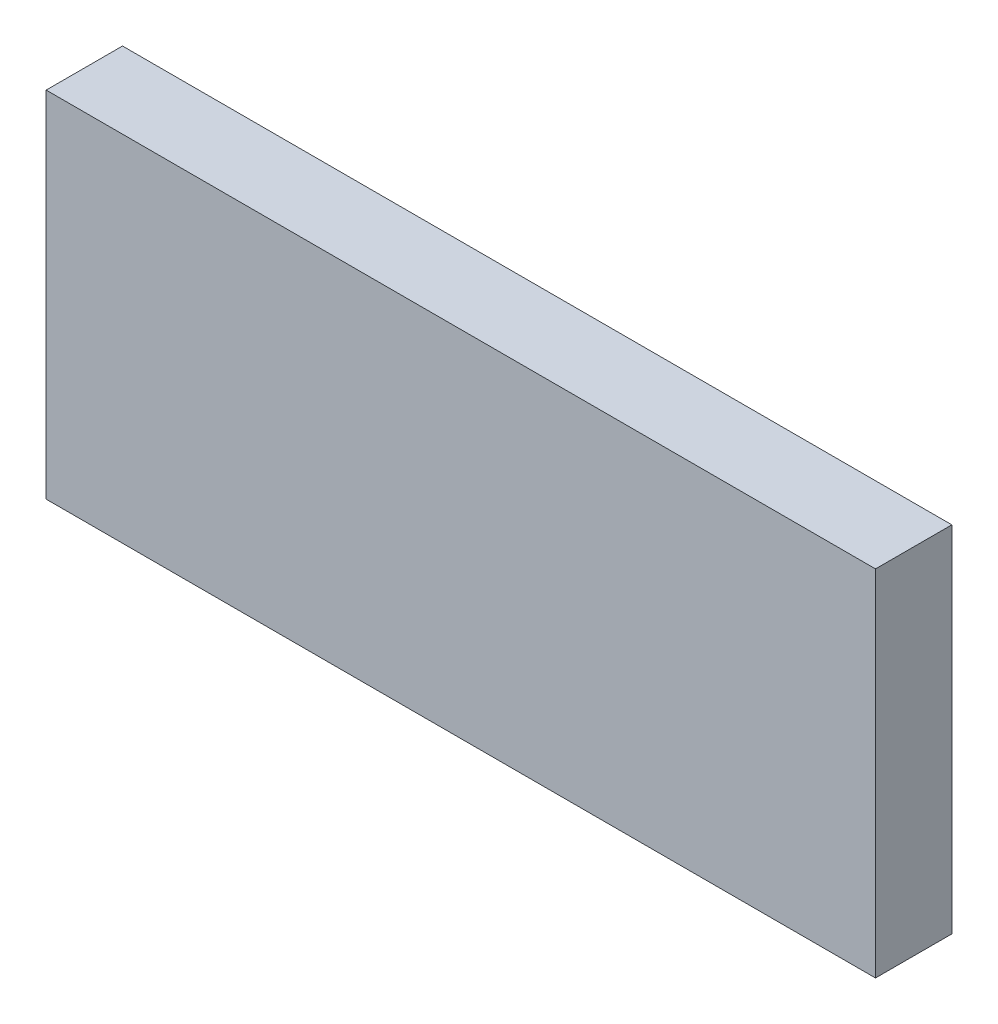
ISO-10303-21;
HEADER;
FILE_DESCRIPTION(('STEP AP214'),'2;1');
FILE_NAME('part.step','',(''),(''),'','','');
FILE_SCHEMA(('AUTOMOTIVE_DESIGN { 1 0 10303 214 1 1 1 1 }'));
ENDSEC;
DATA;
#1=APPLICATION_CONTEXT('core data for automotive mechanical design processes');
#2=APPLICATION_PROTOCOL_DEFINITION('international standard','automotive_design',2000,#1);
#3=PRODUCT_CONTEXT('',#1,'mechanical');
#4=PRODUCT('Part','Part','',(#3));
#5=PRODUCT_RELATED_PRODUCT_CATEGORY('part','',(#4));
#6=PRODUCT_DEFINITION_FORMATION('','',#4);
#7=PRODUCT_DEFINITION_CONTEXT('part definition',#1,'design');
#8=PRODUCT_DEFINITION('design','',#6,#7);
#9=PRODUCT_DEFINITION_SHAPE('','',#8);
#10=(LENGTH_UNIT() NAMED_UNIT(*) SI_UNIT(.MILLI.,.METRE.));
#11=(NAMED_UNIT(*) PLANE_ANGLE_UNIT() SI_UNIT($,.RADIAN.));
#12=(NAMED_UNIT(*) SI_UNIT($,.STERADIAN.) SOLID_ANGLE_UNIT());
#13=UNCERTAINTY_MEASURE_WITH_UNIT(LENGTH_MEASURE(1.E-05),#10,'distance_accuracy_value','');
#14=(GEOMETRIC_REPRESENTATION_CONTEXT(3) GLOBAL_UNCERTAINTY_ASSIGNED_CONTEXT((#13)) GLOBAL_UNIT_ASSIGNED_CONTEXT((#10,
#11,#12)) REPRESENTATION_CONTEXT('',''));
#15=CARTESIAN_POINT('',(0.,0.,0.));
#16=DIRECTION('',(0.,0.,1.));
#17=DIRECTION('',(1.,0.,0.));
#18=AXIS2_PLACEMENT_3D('',#15,#16,#17);
#19=CARTESIAN_POINT('',(-36.7020403086607,21.4105311355311,6.));
#20=DIRECTION('',(1.,0.,0.));
#21=DIRECTION('',(0.,0.,-1.));
#22=AXIS2_PLACEMENT_3D('',#19,#20,#21);
#23=PLANE('',#22);
#24=DIRECTION('',(0.,-1.,0.));
#25=VECTOR('',#24,1.);
#26=CARTESIAN_POINT('',(-36.7020403086607,21.4105311355311,0.));
#27=LINE('',#26,#25);
#28=CARTESIAN_POINT('',(-36.7020403086607,21.4105311355311,0.));
#29=VERTEX_POINT('',#28);
#30=CARTESIAN_POINT('',(-36.7020403086607,-6.43946886446888,0.));
#31=VERTEX_POINT('',#30);
#32=EDGE_CURVE('E97',#29,#31,#27,.T.);
#33=ORIENTED_EDGE('',*,*,#32,.T.);
#34=DIRECTION('',(0.,0.,-1.));
#35=VECTOR('',#34,1.);
#36=CARTESIAN_POINT('',(-36.7020403086607,-6.43946886446888,6.));
#37=LINE('',#36,#35);
#38=CARTESIAN_POINT('',(-36.7020403086607,-6.43946886446888,6.));
#39=VERTEX_POINT('',#38);
#40=EDGE_CURVE('E11',#39,#31,#37,.T.);
#41=ORIENTED_EDGE('',*,*,#40,.F.);
#42=DIRECTION('',(0.,-1.,0.));
#43=VECTOR('',#42,1.);
#44=CARTESIAN_POINT('',(-36.7020403086607,21.4105311355311,6.));
#45=LINE('',#44,#43);
#46=CARTESIAN_POINT('',(-36.7020403086607,21.4105311355311,6.));
#47=VERTEX_POINT('',#46);
#48=EDGE_CURVE('E80',#47,#39,#45,.T.);
#49=ORIENTED_EDGE('',*,*,#48,.F.);
#50=DIRECTION('',(0.,0.,-1.));
#51=VECTOR('',#50,1.);
#52=CARTESIAN_POINT('',(-36.7020403086607,21.4105311355311,6.));
#53=LINE('',#52,#51);
#54=EDGE_CURVE('E41',#47,#29,#53,.T.);
#55=ORIENTED_EDGE('',*,*,#54,.T.);
#56=EDGE_LOOP('',(#33,#41,#49,#55));
#57=FACE_BOUND('',#56,.T.);
#58=ADVANCED_FACE('F33',(#57),#23,.F.);
#59=CARTESIAN_POINT('',(-36.7020403086607,-6.43946886446888,6.));
#60=DIRECTION('',(0.,1.,0.));
#61=DIRECTION('',(0.,0.,1.));
#62=AXIS2_PLACEMENT_3D('',#59,#60,#61);
#63=PLANE('',#62);
#64=DIRECTION('',(1.,0.,0.));
#65=VECTOR('',#64,1.);
#66=CARTESIAN_POINT('',(-36.7020403086607,-6.43946886446888,0.));
#67=LINE('',#66,#65);
#68=CARTESIAN_POINT('',(28.4879596913393,-6.43946886446888,0.));
#69=VERTEX_POINT('',#68);
#70=EDGE_CURVE('E61',#31,#69,#67,.T.);
#71=ORIENTED_EDGE('',*,*,#70,.T.);
#72=DIRECTION('',(0.,0.,-1.));
#73=VECTOR('',#72,1.);
#74=CARTESIAN_POINT('',(28.4879596913393,-6.43946886446888,6.));
#75=LINE('',#74,#73);
#76=CARTESIAN_POINT('',(28.4879596913393,-6.43946886446888,6.));
#77=VERTEX_POINT('',#76);
#78=EDGE_CURVE('E85',#77,#69,#75,.T.);
#79=ORIENTED_EDGE('',*,*,#78,.F.);
#80=DIRECTION('',(1.,0.,0.));
#81=VECTOR('',#80,1.);
#82=CARTESIAN_POINT('',(-36.7020403086607,-6.43946886446888,6.));
#83=LINE('',#82,#81);
#84=EDGE_CURVE('E74',#39,#77,#83,.T.);
#85=ORIENTED_EDGE('',*,*,#84,.F.);
#86=ORIENTED_EDGE('',*,*,#40,.T.);
#87=EDGE_LOOP('',(#71,#79,#85,#86));
#88=FACE_BOUND('',#87,.T.);
#89=ADVANCED_FACE('F86',(#88),#63,.F.);
#90=CARTESIAN_POINT('',(-36.7020403086607,21.4105311355311,6.));
#91=DIRECTION('',(0.,-1.,0.));
#92=DIRECTION('',(0.,0.,-1.));
#93=AXIS2_PLACEMENT_3D('',#90,#91,#92);
#94=PLANE('',#93);
#95=DIRECTION('',(-1.,0.,0.));
#96=VECTOR('',#95,1.);
#97=CARTESIAN_POINT('',(-36.7020403086607,21.4105311355311,0.));
#98=LINE('',#97,#96);
#99=CARTESIAN_POINT('',(28.4879596913393,21.4105311355311,0.));
#100=VERTEX_POINT('',#99);
#101=EDGE_CURVE('E98',#100,#29,#98,.T.);
#102=ORIENTED_EDGE('',*,*,#101,.T.);
#103=ORIENTED_EDGE('',*,*,#54,.F.);
#104=DIRECTION('',(-1.,0.,0.));
#105=VECTOR('',#104,1.);
#106=CARTESIAN_POINT('',(-36.7020403086607,21.4105311355311,6.));
#107=LINE('',#106,#105);
#108=CARTESIAN_POINT('',(28.4879596913393,21.4105311355311,6.));
#109=VERTEX_POINT('',#108);
#110=EDGE_CURVE('E49',#109,#47,#107,.T.);
#111=ORIENTED_EDGE('',*,*,#110,.F.);
#112=DIRECTION('',(0.,0.,1.));
#113=VECTOR('',#112,1.);
#114=CARTESIAN_POINT('',(28.4879596913393,21.4105311355311,6.));
#115=LINE('',#114,#113);
#116=EDGE_CURVE('E92',#100,#109,#115,.T.);
#117=ORIENTED_EDGE('',*,*,#116,.F.);
#118=EDGE_LOOP('',(#102,#103,#111,#117));
#119=FACE_BOUND('',#118,.T.);
#120=ADVANCED_FACE('F107',(#119),#94,.F.);
#121=CARTESIAN_POINT('',(0.,0.,6.));
#122=DIRECTION('',(0.,0.,1.));
#123=DIRECTION('',(1.,0.,0.));
#124=AXIS2_PLACEMENT_3D('',#121,#122,#123);
#125=PLANE('',#124);
#126=ORIENTED_EDGE('',*,*,#48,.T.);
#127=ORIENTED_EDGE('',*,*,#84,.T.);
#128=DIRECTION('',(0.,-1.,0.));
#129=VECTOR('',#128,1.);
#130=CARTESIAN_POINT('',(28.4879596913393,-6.43946886446888,6.));
#131=LINE('',#130,#129);
#132=EDGE_CURVE('E78',#109,#77,#131,.T.);
#133=ORIENTED_EDGE('',*,*,#132,.F.);
#134=ORIENTED_EDGE('',*,*,#110,.T.);
#135=EDGE_LOOP('',(#126,#127,#133,#134));
#136=FACE_BOUND('',#135,.T.);
#137=ADVANCED_FACE('F76',(#136),#125,.T.);
#138=CARTESIAN_POINT('',(0.,0.,0.));
#139=DIRECTION('',(0.,0.,1.));
#140=DIRECTION('',(1.,0.,0.));
#141=AXIS2_PLACEMENT_3D('',#138,#139,#140);
#142=PLANE('',#141);
#143=ORIENTED_EDGE('',*,*,#32,.F.);
#144=ORIENTED_EDGE('',*,*,#101,.F.);
#145=DIRECTION('',(0.,1.,0.));
#146=VECTOR('',#145,1.);
#147=CARTESIAN_POINT('',(28.4879596913393,-6.43946886446888,0.));
#148=LINE('',#147,#146);
#149=EDGE_CURVE('E89',#69,#100,#148,.T.);
#150=ORIENTED_EDGE('',*,*,#149,.F.);
#151=ORIENTED_EDGE('',*,*,#70,.F.);
#152=EDGE_LOOP('',(#143,#144,#150,#151));
#153=FACE_BOUND('',#152,.T.);
#154=ADVANCED_FACE('F106',(#153),#142,.F.);
#155=CARTESIAN_POINT('',(28.4879596913393,0.,0.));
#156=DIRECTION('',(-1.,0.,0.));
#157=DIRECTION('',(0.,0.,1.));
#158=AXIS2_PLACEMENT_3D('',#155,#156,#157);
#159=PLANE('',#158);
#160=ORIENTED_EDGE('',*,*,#132,.T.);
#161=ORIENTED_EDGE('',*,*,#78,.T.);
#162=ORIENTED_EDGE('',*,*,#149,.T.);
#163=ORIENTED_EDGE('',*,*,#116,.T.);
#164=EDGE_LOOP('',(#160,#161,#162,#163));
#165=FACE_BOUND('',#164,.T.);
#166=ADVANCED_FACE('F91',(#165),#159,.F.);
#167=CLOSED_SHELL('',(#58,#89,#120,#137,#154,#166));
#168=MANIFOLD_SOLID_BREP('B2',#167);
#169=ADVANCED_BREP_SHAPE_REPRESENTATION('',(#18,#168),#14);
#170=SHAPE_DEFINITION_REPRESENTATION(#9,#169);
ENDSEC;
END-ISO-10303-21;
